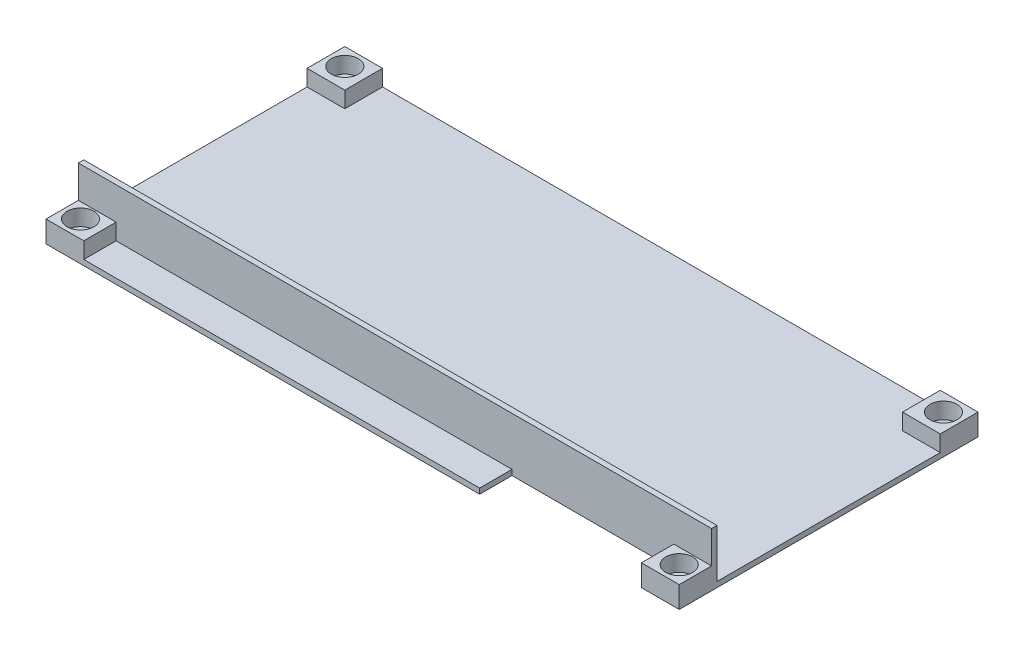
ISO-10303-21;
HEADER;
FILE_DESCRIPTION(('STEP AP214'),'2;1');
FILE_NAME('part.step','',(''),(''),'','','');
FILE_SCHEMA(('AUTOMOTIVE_DESIGN { 1 0 10303 214 1 1 1 1 }'));
ENDSEC;
DATA;
#1=APPLICATION_CONTEXT('core data for automotive mechanical design processes');
#2=APPLICATION_PROTOCOL_DEFINITION('international standard','automotive_design',2000,#1);
#3=PRODUCT_CONTEXT('',#1,'mechanical');
#4=PRODUCT('Part','Part','',(#3));
#5=PRODUCT_RELATED_PRODUCT_CATEGORY('part','',(#4));
#6=PRODUCT_DEFINITION_FORMATION('','',#4);
#7=PRODUCT_DEFINITION_CONTEXT('part definition',#1,'design');
#8=PRODUCT_DEFINITION('design','',#6,#7);
#9=PRODUCT_DEFINITION_SHAPE('','',#8);
#10=(LENGTH_UNIT() NAMED_UNIT(*) SI_UNIT(.MILLI.,.METRE.));
#11=(NAMED_UNIT(*) PLANE_ANGLE_UNIT() SI_UNIT($,.RADIAN.));
#12=(NAMED_UNIT(*) SI_UNIT($,.STERADIAN.) SOLID_ANGLE_UNIT());
#13=UNCERTAINTY_MEASURE_WITH_UNIT(LENGTH_MEASURE(1.E-05),#10,'distance_accuracy_value','');
#14=(GEOMETRIC_REPRESENTATION_CONTEXT(3) GLOBAL_UNCERTAINTY_ASSIGNED_CONTEXT((#13)) GLOBAL_UNIT_ASSIGNED_CONTEXT((#10,
#11,#12)) REPRESENTATION_CONTEXT('',''));
#15=CARTESIAN_POINT('',(0.,0.,0.));
#16=DIRECTION('',(0.,0.,1.));
#17=DIRECTION('',(1.,0.,0.));
#18=AXIS2_PLACEMENT_3D('',#15,#16,#17);
#19=CARTESIAN_POINT('',(0.,1.,0.));
#20=DIRECTION('',(0.,-1.,0.));
#21=DIRECTION('',(0.,0.,-1.));
#22=AXIS2_PLACEMENT_3D('',#19,#20,#21);
#23=PLANE('',#22);
#24=DIRECTION('',(0.,0.,1.));
#25=VECTOR('',#24,1.);
#26=CARTESIAN_POINT('',(-58.7,1.,27.7));
#27=LINE('',#26,#25);
#28=CARTESIAN_POINT('',(-58.7,1.,-20.7));
#29=VERTEX_POINT('',#28);
#30=CARTESIAN_POINT('',(-58.7,1.,20.7));
#31=VERTEX_POINT('',#30);
#32=EDGE_CURVE('E343',#29,#31,#27,.T.);
#33=ORIENTED_EDGE('',*,*,#32,.T.);
#34=DIRECTION('',(-1.,0.,0.));
#35=VECTOR('',#34,1.);
#36=CARTESIAN_POINT('',(58.7,1.,20.7));
#37=LINE('',#36,#35);
#38=CARTESIAN_POINT('',(58.7,1.,20.7));
#39=VERTEX_POINT('',#38);
#40=EDGE_CURVE('E283',#39,#31,#37,.T.);
#41=ORIENTED_EDGE('',*,*,#40,.F.);
#42=DIRECTION('',(0.,0.,-1.));
#43=VECTOR('',#42,1.);
#44=CARTESIAN_POINT('',(58.7,1.,27.7));
#45=LINE('',#44,#43);
#46=CARTESIAN_POINT('',(58.7,1.,-20.7));
#47=VERTEX_POINT('',#46);
#48=EDGE_CURVE('E180',#39,#47,#45,.T.);
#49=ORIENTED_EDGE('',*,*,#48,.T.);
#50=DIRECTION('',(1.,0.,0.));
#51=VECTOR('',#50,1.);
#52=CARTESIAN_POINT('',(58.7,1.,-20.7));
#53=LINE('',#52,#51);
#54=CARTESIAN_POINT('',(51.7,1.,-20.7));
#55=VERTEX_POINT('',#54);
#56=EDGE_CURVE('E295',#55,#47,#53,.T.);
#57=ORIENTED_EDGE('',*,*,#56,.F.);
#58=DIRECTION('',(0.,0.,1.));
#59=VECTOR('',#58,1.);
#60=CARTESIAN_POINT('',(51.7,1.,-27.7));
#61=LINE('',#60,#59);
#62=CARTESIAN_POINT('',(51.7,1.,-27.7));
#63=VERTEX_POINT('',#62);
#64=EDGE_CURVE('E182',#63,#55,#61,.T.);
#65=ORIENTED_EDGE('',*,*,#64,.F.);
#66=DIRECTION('',(-1.,0.,0.));
#67=VECTOR('',#66,1.);
#68=CARTESIAN_POINT('',(-58.7,1.,-27.7));
#69=LINE('',#68,#67);
#70=CARTESIAN_POINT('',(-51.7,1.,-27.7));
#71=VERTEX_POINT('',#70);
#72=EDGE_CURVE('E340',#63,#71,#69,.T.);
#73=ORIENTED_EDGE('',*,*,#72,.T.);
#74=DIRECTION('',(0.,0.,-1.));
#75=VECTOR('',#74,1.);
#76=CARTESIAN_POINT('',(-51.7,1.,-27.7));
#77=LINE('',#76,#75);
#78=CARTESIAN_POINT('',(-51.7,1.,-20.7));
#79=VERTEX_POINT('',#78);
#80=EDGE_CURVE('E318',#79,#71,#77,.T.);
#81=ORIENTED_EDGE('',*,*,#80,.F.);
#82=DIRECTION('',(1.,0.,0.));
#83=VECTOR('',#82,1.);
#84=CARTESIAN_POINT('',(-58.7,1.,-20.7));
#85=LINE('',#84,#83);
#86=EDGE_CURVE('E313',#29,#79,#85,.T.);
#87=ORIENTED_EDGE('',*,*,#86,.F.);
#88=EDGE_LOOP('',(#33,#41,#49,#57,#65,#73,#81,#87));
#89=FACE_BOUND('',#88,.T.);
#90=ADVANCED_FACE('F35',(#89),#23,.F.);
#91=DIRECTION('',(1.,0.,0.));
#92=VECTOR('',#91,1.);
#93=CARTESIAN_POINT('',(58.7,1.,21.7));
#94=LINE('',#93,#92);
#95=CARTESIAN_POINT('',(-51.7,1.,21.7));
#96=VERTEX_POINT('',#95);
#97=CARTESIAN_POINT('',(21.7,1.,21.7));
#98=VERTEX_POINT('',#97);
#99=EDGE_CURVE('E198',#96,#98,#94,.T.);
#100=ORIENTED_EDGE('',*,*,#99,.F.);
#101=DIRECTION('',(0.,0.,-1.));
#102=VECTOR('',#101,1.);
#103=CARTESIAN_POINT('',(-51.7,1.,27.7));
#104=LINE('',#103,#102);
#105=CARTESIAN_POINT('',(-51.7,1.,27.7));
#106=VERTEX_POINT('',#105);
#107=EDGE_CURVE('E269',#106,#96,#104,.T.);
#108=ORIENTED_EDGE('',*,*,#107,.F.);
#109=DIRECTION('',(1.,0.,0.));
#110=VECTOR('',#109,1.);
#111=CARTESIAN_POINT('',(-58.7,1.,27.7));
#112=LINE('',#111,#110);
#113=CARTESIAN_POINT('',(21.7,1.,27.7));
#114=VERTEX_POINT('',#113);
#115=EDGE_CURVE('E346',#106,#114,#112,.T.);
#116=ORIENTED_EDGE('',*,*,#115,.T.);
#117=DIRECTION('',(0.,0.,-1.));
#118=VECTOR('',#117,1.);
#119=CARTESIAN_POINT('',(21.7,1.,0.));
#120=LINE('',#119,#118);
#121=EDGE_CURVE('E251',#114,#98,#120,.T.);
#122=ORIENTED_EDGE('',*,*,#121,.T.);
#123=EDGE_LOOP('',(#100,#108,#116,#122));
#124=FACE_BOUND('',#123,.T.);
#125=ADVANCED_FACE('F399',(#124),#23,.F.);
#126=CARTESIAN_POINT('',(51.7,4.,27.7));
#127=DIRECTION('',(1.,0.,0.));
#128=DIRECTION('',(0.,0.,-1.));
#129=AXIS2_PLACEMENT_3D('',#126,#127,#128);
#130=PLANE('',#129);
#131=DIRECTION('',(0.,0.,1.));
#132=VECTOR('',#131,1.);
#133=CARTESIAN_POINT('',(51.7,4.,27.7));
#134=LINE('',#133,#132);
#135=CARTESIAN_POINT('',(51.7,4.,21.7));
#136=VERTEX_POINT('',#135);
#137=CARTESIAN_POINT('',(51.7,4.,27.7));
#138=VERTEX_POINT('',#137);
#139=EDGE_CURVE('E287',#136,#138,#134,.T.);
#140=ORIENTED_EDGE('',*,*,#139,.F.);
#141=DIRECTION('',(0.,-1.,0.));
#142=VECTOR('',#141,1.);
#143=CARTESIAN_POINT('',(51.7,4.,21.7));
#144=LINE('',#143,#142);
#145=CARTESIAN_POINT('',(51.7,0.,21.7));
#146=VERTEX_POINT('',#145);
#147=EDGE_CURVE('E50',#136,#146,#144,.T.);
#148=ORIENTED_EDGE('',*,*,#147,.T.);
#149=DIRECTION('',(0.,0.,1.));
#150=VECTOR('',#149,1.);
#151=CARTESIAN_POINT('',(51.7,0.,27.7));
#152=LINE('',#151,#150);
#153=CARTESIAN_POINT('',(51.7,0.,27.7));
#154=VERTEX_POINT('',#153);
#155=EDGE_CURVE('E240',#146,#154,#152,.T.);
#156=ORIENTED_EDGE('',*,*,#155,.T.);
#157=DIRECTION('',(0.,-1.,0.));
#158=VECTOR('',#157,1.);
#159=CARTESIAN_POINT('',(51.7,4.,27.7));
#160=LINE('',#159,#158);
#161=EDGE_CURVE('E183',#138,#154,#160,.T.);
#162=ORIENTED_EDGE('',*,*,#161,.F.);
#163=EDGE_LOOP('',(#140,#148,#156,#162));
#164=FACE_BOUND('',#163,.T.);
#165=ADVANCED_FACE('F405',(#164),#130,.F.);
#166=CARTESIAN_POINT('',(0.,4.,0.));
#167=DIRECTION('',(0.,-1.,0.));
#168=DIRECTION('',(0.,0.,-1.));
#169=AXIS2_PLACEMENT_3D('',#166,#167,#168);
#170=PLANE('',#169);
#171=CARTESIAN_POINT('',(55.5,4.,24.5));
#172=DIRECTION('',(0.,1.,0.));
#173=DIRECTION('',(0.,0.,1.));
#174=AXIS2_PLACEMENT_3D('',#171,#172,#173);
#175=CIRCLE('',#174,2.5);
#176=CARTESIAN_POINT('',(55.5,4.,27.));
#177=VERTEX_POINT('',#176);
#178=EDGE_CURVE('E224',#177,#177,#175,.T.);
#179=ORIENTED_EDGE('',*,*,#178,.F.);
#180=EDGE_LOOP('',(#179));
#181=FACE_BOUND('',#180,.T.);
#182=DIRECTION('',(1.,0.,0.));
#183=VECTOR('',#182,1.);
#184=CARTESIAN_POINT('',(0.,4.,21.7));
#185=LINE('',#184,#183);
#186=CARTESIAN_POINT('',(58.7,4.,21.7));
#187=VERTEX_POINT('',#186);
#188=EDGE_CURVE('E213',#136,#187,#185,.T.);
#189=ORIENTED_EDGE('',*,*,#188,.F.);
#190=ORIENTED_EDGE('',*,*,#139,.T.);
#191=DIRECTION('',(1.,0.,0.));
#192=VECTOR('',#191,1.);
#193=CARTESIAN_POINT('',(58.7,4.,27.7));
#194=LINE('',#193,#192);
#195=CARTESIAN_POINT('',(58.7,4.,27.7));
#196=VERTEX_POINT('',#195);
#197=EDGE_CURVE('E284',#138,#196,#194,.T.);
#198=ORIENTED_EDGE('',*,*,#197,.T.);
#199=DIRECTION('',(0.,0.,-1.));
#200=VECTOR('',#199,1.);
#201=CARTESIAN_POINT('',(58.7,4.,27.7));
#202=LINE('',#201,#200);
#203=EDGE_CURVE('E57',#196,#187,#202,.T.);
#204=ORIENTED_EDGE('',*,*,#203,.T.);
#205=EDGE_LOOP('',(#189,#190,#198,#204));
#206=FACE_BOUND('',#205,.T.);
#207=ADVANCED_FACE('F449',(#181,#206),#170,.F.);
#208=CARTESIAN_POINT('',(-51.7,4.,27.7));
#209=DIRECTION('',(-1.,0.,0.));
#210=DIRECTION('',(0.,0.,1.));
#211=AXIS2_PLACEMENT_3D('',#208,#209,#210);
#212=PLANE('',#211);
#213=DIRECTION('',(0.,-1.,0.));
#214=VECTOR('',#213,1.);
#215=CARTESIAN_POINT('',(-51.7,4.,21.7));
#216=LINE('',#215,#214);
#217=CARTESIAN_POINT('',(-51.7,4.,21.7));
#218=VERTEX_POINT('',#217);
#219=EDGE_CURVE('E210',#218,#96,#216,.T.);
#220=ORIENTED_EDGE('',*,*,#219,.F.);
#221=DIRECTION('',(0.,0.,-1.));
#222=VECTOR('',#221,1.);
#223=CARTESIAN_POINT('',(-51.7,4.,27.7));
#224=LINE('',#223,#222);
#225=CARTESIAN_POINT('',(-51.7,4.,27.7));
#226=VERTEX_POINT('',#225);
#227=EDGE_CURVE('E274',#226,#218,#224,.T.);
#228=ORIENTED_EDGE('',*,*,#227,.F.);
#229=DIRECTION('',(0.,-1.,0.));
#230=VECTOR('',#229,1.);
#231=CARTESIAN_POINT('',(-51.7,4.,27.7));
#232=LINE('',#231,#230);
#233=EDGE_CURVE('E280',#226,#106,#232,.T.);
#234=ORIENTED_EDGE('',*,*,#233,.T.);
#235=ORIENTED_EDGE('',*,*,#107,.T.);
#236=EDGE_LOOP('',(#220,#228,#234,#235));
#237=FACE_BOUND('',#236,.T.);
#238=ADVANCED_FACE('F593',(#237),#212,.F.);
#239=CARTESIAN_POINT('',(0.,4.,0.));
#240=DIRECTION('',(0.,-1.,0.));
#241=DIRECTION('',(0.,0.,-1.));
#242=AXIS2_PLACEMENT_3D('',#239,#240,#241);
#243=PLANE('',#242);
#244=CARTESIAN_POINT('',(-55.5,4.,24.5));
#245=DIRECTION('',(0.,1.,0.));
#246=DIRECTION('',(0.,0.,1.));
#247=AXIS2_PLACEMENT_3D('',#244,#245,#246);
#248=CIRCLE('',#247,2.5);
#249=CARTESIAN_POINT('',(-55.5,4.,27.));
#250=VERTEX_POINT('',#249);
#251=EDGE_CURVE('E215',#250,#250,#248,.T.);
#252=ORIENTED_EDGE('',*,*,#251,.F.);
#253=EDGE_LOOP('',(#252));
#254=FACE_BOUND('',#253,.T.);
#255=DIRECTION('',(1.,0.,0.));
#256=VECTOR('',#255,1.);
#257=CARTESIAN_POINT('',(0.,4.,21.7));
#258=LINE('',#257,#256);
#259=CARTESIAN_POINT('',(-58.7,4.,21.7));
#260=VERTEX_POINT('',#259);
#261=EDGE_CURVE('E12',#260,#218,#258,.T.);
#262=ORIENTED_EDGE('',*,*,#261,.F.);
#263=DIRECTION('',(0.,0.,1.));
#264=VECTOR('',#263,1.);
#265=CARTESIAN_POINT('',(-58.7,4.,27.7));
#266=LINE('',#265,#264);
#267=CARTESIAN_POINT('',(-58.7,4.,27.7));
#268=VERTEX_POINT('',#267);
#269=EDGE_CURVE('E270',#260,#268,#266,.T.);
#270=ORIENTED_EDGE('',*,*,#269,.T.);
#271=DIRECTION('',(1.,0.,0.));
#272=VECTOR('',#271,1.);
#273=CARTESIAN_POINT('',(-58.7,4.,27.7));
#274=LINE('',#273,#272);
#275=EDGE_CURVE('E272',#268,#226,#274,.T.);
#276=ORIENTED_EDGE('',*,*,#275,.T.);
#277=ORIENTED_EDGE('',*,*,#227,.T.);
#278=EDGE_LOOP('',(#262,#270,#276,#277));
#279=FACE_BOUND('',#278,.T.);
#280=ADVANCED_FACE('F602',(#254,#279),#243,.F.);
#281=CARTESIAN_POINT('',(-58.7,1.,27.7));
#282=DIRECTION('',(0.,0.,-1.));
#283=DIRECTION('',(-1.,0.,0.));
#284=AXIS2_PLACEMENT_3D('',#281,#282,#283);
#285=PLANE('',#284);
#286=ORIENTED_EDGE('',*,*,#161,.T.);
#287=DIRECTION('',(1.,0.,0.));
#288=VECTOR('',#287,1.);
#289=CARTESIAN_POINT('',(-58.7,0.,27.7));
#290=LINE('',#289,#288);
#291=CARTESIAN_POINT('',(58.7,0.,27.7));
#292=VERTEX_POINT('',#291);
#293=EDGE_CURVE('E356',#154,#292,#290,.T.);
#294=ORIENTED_EDGE('',*,*,#293,.T.);
#295=DIRECTION('',(0.,-1.,0.));
#296=VECTOR('',#295,1.);
#297=CARTESIAN_POINT('',(58.7,1.,27.7));
#298=LINE('',#297,#296);
#299=EDGE_CURVE('E349',#196,#292,#298,.T.);
#300=ORIENTED_EDGE('',*,*,#299,.F.);
#301=ORIENTED_EDGE('',*,*,#197,.F.);
#302=EDGE_LOOP('',(#286,#294,#300,#301));
#303=FACE_BOUND('',#302,.T.);
#304=ADVANCED_FACE('F420',(#303),#285,.F.);
#305=CARTESIAN_POINT('',(58.7,1.,27.7));
#306=DIRECTION('',(-1.,0.,0.));
#307=DIRECTION('',(0.,0.,1.));
#308=AXIS2_PLACEMENT_3D('',#305,#306,#307);
#309=PLANE('',#308);
#310=DIRECTION('',(0.,-1.,0.));
#311=VECTOR('',#310,1.);
#312=CARTESIAN_POINT('',(58.7,4.,20.7));
#313=LINE('',#312,#311);
#314=CARTESIAN_POINT('',(58.7,10.,20.7));
#315=VERTEX_POINT('',#314);
#316=EDGE_CURVE('E174',#315,#39,#313,.T.);
#317=ORIENTED_EDGE('',*,*,#316,.F.);
#318=DIRECTION('',(0.,0.,-1.));
#319=VECTOR('',#318,1.);
#320=CARTESIAN_POINT('',(58.7,10.,21.7));
#321=LINE('',#320,#319);
#322=CARTESIAN_POINT('',(58.7,10.,21.7));
#323=VERTEX_POINT('',#322);
#324=EDGE_CURVE('E178',#323,#315,#321,.T.);
#325=ORIENTED_EDGE('',*,*,#324,.F.);
#326=DIRECTION('',(0.,-1.,0.));
#327=VECTOR('',#326,1.);
#328=CARTESIAN_POINT('',(58.7,10.,21.7));
#329=LINE('',#328,#327);
#330=EDGE_CURVE('E204',#323,#187,#329,.T.);
#331=ORIENTED_EDGE('',*,*,#330,.T.);
#332=ORIENTED_EDGE('',*,*,#203,.F.);
#333=ORIENTED_EDGE('',*,*,#299,.T.);
#334=DIRECTION('',(0.,0.,-1.));
#335=VECTOR('',#334,1.);
#336=CARTESIAN_POINT('',(58.7,0.,27.7));
#337=LINE('',#336,#335);
#338=CARTESIAN_POINT('',(58.7,0.,-27.7));
#339=VERTEX_POINT('',#338);
#340=EDGE_CURVE('E338',#292,#339,#337,.T.);
#341=ORIENTED_EDGE('',*,*,#340,.T.);
#342=DIRECTION('',(0.,-1.,0.));
#343=VECTOR('',#342,1.);
#344=CARTESIAN_POINT('',(58.7,1.,-27.7));
#345=LINE('',#344,#343);
#346=CARTESIAN_POINT('',(58.7,4.,-27.7));
#347=VERTEX_POINT('',#346);
#348=EDGE_CURVE('E43',#347,#339,#345,.T.);
#349=ORIENTED_EDGE('',*,*,#348,.F.);
#350=DIRECTION('',(0.,0.,-1.));
#351=VECTOR('',#350,1.);
#352=CARTESIAN_POINT('',(58.7,4.,-27.7));
#353=LINE('',#352,#351);
#354=CARTESIAN_POINT('',(58.7,4.,-20.7));
#355=VERTEX_POINT('',#354);
#356=EDGE_CURVE('E291',#355,#347,#353,.T.);
#357=ORIENTED_EDGE('',*,*,#356,.F.);
#358=DIRECTION('',(0.,-1.,0.));
#359=VECTOR('',#358,1.);
#360=CARTESIAN_POINT('',(58.7,4.,-20.7));
#361=LINE('',#360,#359);
#362=EDGE_CURVE('E301',#355,#47,#361,.T.);
#363=ORIENTED_EDGE('',*,*,#362,.T.);
#364=ORIENTED_EDGE('',*,*,#48,.F.);
#365=EDGE_LOOP('',(#317,#325,#331,#332,#333,#341,#349,#357,#363,#364));
#366=FACE_BOUND('',#365,.T.);
#367=ADVANCED_FACE('F37',(#366),#309,.F.);
#368=CARTESIAN_POINT('',(-58.7,1.,-27.7));
#369=DIRECTION('',(0.,0.,1.));
#370=DIRECTION('',(1.,0.,0.));
#371=AXIS2_PLACEMENT_3D('',#368,#369,#370);
#372=PLANE('',#371);
#373=DIRECTION('',(-1.,0.,0.));
#374=VECTOR('',#373,1.);
#375=CARTESIAN_POINT('',(-58.7,0.,-27.7));
#376=LINE('',#375,#374);
#377=CARTESIAN_POINT('',(-58.7,0.,-27.7));
#378=VERTEX_POINT('',#377);
#379=EDGE_CURVE('E352',#339,#378,#376,.T.);
#380=ORIENTED_EDGE('',*,*,#379,.T.);
#381=DIRECTION('',(0.,-1.,0.));
#382=VECTOR('',#381,1.);
#383=CARTESIAN_POINT('',(-58.7,1.,-27.7));
#384=LINE('',#383,#382);
#385=CARTESIAN_POINT('',(-58.7,4.,-27.7));
#386=VERTEX_POINT('',#385);
#387=EDGE_CURVE('E364',#386,#378,#384,.T.);
#388=ORIENTED_EDGE('',*,*,#387,.F.);
#389=DIRECTION('',(-1.,0.,0.));
#390=VECTOR('',#389,1.);
#391=CARTESIAN_POINT('',(-58.7,4.,-27.7));
#392=LINE('',#391,#390);
#393=CARTESIAN_POINT('',(-51.7,4.,-27.7));
#394=VERTEX_POINT('',#393);
#395=EDGE_CURVE('E322',#394,#386,#392,.T.);
#396=ORIENTED_EDGE('',*,*,#395,.F.);
#397=DIRECTION('',(0.,-1.,0.));
#398=VECTOR('',#397,1.);
#399=CARTESIAN_POINT('',(-51.7,4.,-27.7));
#400=LINE('',#399,#398);
#401=EDGE_CURVE('E325',#394,#71,#400,.T.);
#402=ORIENTED_EDGE('',*,*,#401,.T.);
#403=ORIENTED_EDGE('',*,*,#72,.F.);
#404=DIRECTION('',(0.,-1.,0.));
#405=VECTOR('',#404,1.);
#406=CARTESIAN_POINT('',(51.7,4.,-27.7));
#407=LINE('',#406,#405);
#408=CARTESIAN_POINT('',(51.7,4.,-27.7));
#409=VERTEX_POINT('',#408);
#410=EDGE_CURVE('E310',#409,#63,#407,.T.);
#411=ORIENTED_EDGE('',*,*,#410,.F.);
#412=DIRECTION('',(-1.,0.,0.));
#413=VECTOR('',#412,1.);
#414=CARTESIAN_POINT('',(58.7,4.,-27.7));
#415=LINE('',#414,#413);
#416=EDGE_CURVE('E294',#347,#409,#415,.T.);
#417=ORIENTED_EDGE('',*,*,#416,.F.);
#418=ORIENTED_EDGE('',*,*,#348,.T.);
#419=EDGE_LOOP('',(#380,#388,#396,#402,#403,#411,#417,#418));
#420=FACE_BOUND('',#419,.T.);
#421=ADVANCED_FACE('F422',(#420),#372,.F.);
#422=CARTESIAN_POINT('',(-58.7,1.,27.7));
#423=DIRECTION('',(1.,0.,0.));
#424=DIRECTION('',(0.,0.,-1.));
#425=AXIS2_PLACEMENT_3D('',#422,#423,#424);
#426=PLANE('',#425);
#427=ORIENTED_EDGE('',*,*,#269,.F.);
#428=DIRECTION('',(0.,-1.,0.));
#429=VECTOR('',#428,1.);
#430=CARTESIAN_POINT('',(-58.7,10.,21.7));
#431=LINE('',#430,#429);
#432=CARTESIAN_POINT('',(-58.7,10.,21.7));
#433=VERTEX_POINT('',#432);
#434=EDGE_CURVE('E207',#433,#260,#431,.T.);
#435=ORIENTED_EDGE('',*,*,#434,.F.);
#436=DIRECTION('',(0.,0.,1.));
#437=VECTOR('',#436,1.);
#438=CARTESIAN_POINT('',(-58.7,10.,21.7));
#439=LINE('',#438,#437);
#440=CARTESIAN_POINT('',(-58.7,10.,20.7));
#441=VERTEX_POINT('',#440);
#442=EDGE_CURVE('E192',#441,#433,#439,.T.);
#443=ORIENTED_EDGE('',*,*,#442,.F.);
#444=DIRECTION('',(0.,-1.,0.));
#445=VECTOR('',#444,1.);
#446=CARTESIAN_POINT('',(-58.7,4.,20.7));
#447=LINE('',#446,#445);
#448=EDGE_CURVE('E189',#441,#31,#447,.T.);
#449=ORIENTED_EDGE('',*,*,#448,.T.);
#450=ORIENTED_EDGE('',*,*,#32,.F.);
#451=DIRECTION('',(0.,-1.,0.));
#452=VECTOR('',#451,1.);
#453=CARTESIAN_POINT('',(-58.7,4.,-20.7));
#454=LINE('',#453,#452);
#455=CARTESIAN_POINT('',(-58.7,4.,-20.7));
#456=VERTEX_POINT('',#455);
#457=EDGE_CURVE('E335',#456,#29,#454,.T.);
#458=ORIENTED_EDGE('',*,*,#457,.F.);
#459=DIRECTION('',(0.,0.,1.));
#460=VECTOR('',#459,1.);
#461=CARTESIAN_POINT('',(-58.7,4.,-27.7));
#462=LINE('',#461,#460);
#463=EDGE_CURVE('E314',#386,#456,#462,.T.);
#464=ORIENTED_EDGE('',*,*,#463,.F.);
#465=ORIENTED_EDGE('',*,*,#387,.T.);
#466=DIRECTION('',(0.,0.,1.));
#467=VECTOR('',#466,1.);
#468=CARTESIAN_POINT('',(-58.7,0.,27.7));
#469=LINE('',#468,#467);
#470=CARTESIAN_POINT('',(-58.7,0.,27.7));
#471=VERTEX_POINT('',#470);
#472=EDGE_CURVE('E354',#378,#471,#469,.T.);
#473=ORIENTED_EDGE('',*,*,#472,.T.);
#474=DIRECTION('',(0.,-1.,0.));
#475=VECTOR('',#474,1.);
#476=CARTESIAN_POINT('',(-58.7,1.,27.7));
#477=LINE('',#476,#475);
#478=EDGE_CURVE('E361',#268,#471,#477,.T.);
#479=ORIENTED_EDGE('',*,*,#478,.F.);
#480=EDGE_LOOP('',(#427,#435,#443,#449,#450,#458,#464,#465,#473,#479));
#481=FACE_BOUND('',#480,.T.);
#482=ADVANCED_FACE('F418',(#481),#426,.F.);
#483=CARTESIAN_POINT('',(21.7,0.,27.7));
#484=VERTEX_POINT('',#483);
#485=EDGE_CURVE('E341',#471,#484,#290,.T.);
#486=ORIENTED_EDGE('',*,*,#485,.T.);
#487=DIRECTION('',(0.,-1.,0.));
#488=VECTOR('',#487,1.);
#489=CARTESIAN_POINT('',(21.7,4.,27.7));
#490=LINE('',#489,#488);
#491=EDGE_CURVE('E249',#114,#484,#490,.T.);
#492=ORIENTED_EDGE('',*,*,#491,.F.);
#493=ORIENTED_EDGE('',*,*,#115,.F.);
#494=ORIENTED_EDGE('',*,*,#233,.F.);
#495=ORIENTED_EDGE('',*,*,#275,.F.);
#496=ORIENTED_EDGE('',*,*,#478,.T.);
#497=EDGE_LOOP('',(#486,#492,#493,#494,#495,#496));
#498=FACE_BOUND('',#497,.T.);
#499=ADVANCED_FACE('F414',(#498),#285,.F.);
#500=CARTESIAN_POINT('',(0.,0.,0.));
#501=DIRECTION('',(0.,-1.,0.));
#502=DIRECTION('',(0.,0.,-1.));
#503=AXIS2_PLACEMENT_3D('',#500,#501,#502);
#504=PLANE('',#503);
#505=ORIENTED_EDGE('',*,*,#155,.F.);
#506=DIRECTION('',(1.,0.,0.));
#507=VECTOR('',#506,1.);
#508=CARTESIAN_POINT('',(51.7,0.,21.7));
#509=LINE('',#508,#507);
#510=CARTESIAN_POINT('',(21.7,0.,21.7));
#511=VERTEX_POINT('',#510);
#512=EDGE_CURVE('E247',#511,#146,#509,.T.);
#513=ORIENTED_EDGE('',*,*,#512,.F.);
#514=DIRECTION('',(0.,0.,-1.));
#515=VECTOR('',#514,1.);
#516=CARTESIAN_POINT('',(21.7,0.,27.7));
#517=LINE('',#516,#515);
#518=EDGE_CURVE('E243',#484,#511,#517,.T.);
#519=ORIENTED_EDGE('',*,*,#518,.F.);
#520=ORIENTED_EDGE('',*,*,#485,.F.);
#521=ORIENTED_EDGE('',*,*,#472,.F.);
#522=ORIENTED_EDGE('',*,*,#379,.F.);
#523=ORIENTED_EDGE('',*,*,#340,.F.);
#524=ORIENTED_EDGE('',*,*,#293,.F.);
#525=EDGE_LOOP('',(#505,#513,#519,#520,#521,#522,#523,#524));
#526=FACE_BOUND('',#525,.T.);
#527=CARTESIAN_POINT('',(-55.5,0.,24.5));
#528=DIRECTION('',(0.,1.,0.));
#529=DIRECTION('',(0.,0.,1.));
#530=AXIS2_PLACEMENT_3D('',#527,#528,#529);
#531=CIRCLE('',#530,1.35);
#532=CARTESIAN_POINT('',(-55.5,0.,25.85));
#533=VERTEX_POINT('',#532);
#534=EDGE_CURVE('E257',#533,#533,#531,.T.);
#535=ORIENTED_EDGE('',*,*,#534,.T.);
#536=EDGE_LOOP('',(#535));
#537=FACE_BOUND('',#536,.T.);
#538=CARTESIAN_POINT('',(55.5,0.,24.5));
#539=DIRECTION('',(0.,1.,0.));
#540=DIRECTION('',(0.,0.,1.));
#541=AXIS2_PLACEMENT_3D('',#538,#539,#540);
#542=CIRCLE('',#541,1.35);
#543=CARTESIAN_POINT('',(55.5,0.,25.85));
#544=VERTEX_POINT('',#543);
#545=EDGE_CURVE('E262',#544,#544,#542,.T.);
#546=ORIENTED_EDGE('',*,*,#545,.T.);
#547=EDGE_LOOP('',(#546));
#548=FACE_BOUND('',#547,.T.);
#549=CARTESIAN_POINT('',(55.5,0.,-24.5));
#550=DIRECTION('',(0.,1.,0.));
#551=DIRECTION('',(0.,0.,1.));
#552=AXIS2_PLACEMENT_3D('',#549,#550,#551);
#553=CIRCLE('',#552,1.35);
#554=CARTESIAN_POINT('',(55.5,0.,-23.15));
#555=VERTEX_POINT('',#554);
#556=EDGE_CURVE('E258',#555,#555,#553,.T.);
#557=ORIENTED_EDGE('',*,*,#556,.T.);
#558=EDGE_LOOP('',(#557));
#559=FACE_BOUND('',#558,.T.);
#560=CARTESIAN_POINT('',(-55.5,0.,-24.5));
#561=DIRECTION('',(0.,1.,0.));
#562=DIRECTION('',(0.,0.,1.));
#563=AXIS2_PLACEMENT_3D('',#560,#561,#562);
#564=CIRCLE('',#563,1.35);
#565=CARTESIAN_POINT('',(-55.5,0.,-23.15));
#566=VERTEX_POINT('',#565);
#567=EDGE_CURVE('E261',#566,#566,#564,.T.);
#568=ORIENTED_EDGE('',*,*,#567,.T.);
#569=EDGE_LOOP('',(#568));
#570=FACE_BOUND('',#569,.T.);
#571=ADVANCED_FACE('F411',(#526,#537,#548,#559,#570),#504,.T.);
#572=CARTESIAN_POINT('',(-58.7,4.,-20.7));
#573=DIRECTION('',(0.,0.,-1.));
#574=DIRECTION('',(-1.,0.,0.));
#575=AXIS2_PLACEMENT_3D('',#572,#573,#574);
#576=PLANE('',#575);
#577=ORIENTED_EDGE('',*,*,#86,.T.);
#578=DIRECTION('',(0.,-1.,0.));
#579=VECTOR('',#578,1.);
#580=CARTESIAN_POINT('',(-51.7,4.,-20.7));
#581=LINE('',#580,#579);
#582=CARTESIAN_POINT('',(-51.7,4.,-20.7));
#583=VERTEX_POINT('',#582);
#584=EDGE_CURVE('E332',#583,#79,#581,.T.);
#585=ORIENTED_EDGE('',*,*,#584,.F.);
#586=DIRECTION('',(1.,0.,0.));
#587=VECTOR('',#586,1.);
#588=CARTESIAN_POINT('',(-58.7,4.,-20.7));
#589=LINE('',#588,#587);
#590=EDGE_CURVE('E317',#456,#583,#589,.T.);
#591=ORIENTED_EDGE('',*,*,#590,.F.);
#592=ORIENTED_EDGE('',*,*,#457,.T.);
#593=EDGE_LOOP('',(#577,#585,#591,#592));
#594=FACE_BOUND('',#593,.T.);
#595=ADVANCED_FACE('F409',(#594),#576,.F.);
#596=CARTESIAN_POINT('',(-51.7,4.,-27.7));
#597=DIRECTION('',(-1.,0.,0.));
#598=DIRECTION('',(0.,0.,1.));
#599=AXIS2_PLACEMENT_3D('',#596,#597,#598);
#600=PLANE('',#599);
#601=ORIENTED_EDGE('',*,*,#80,.T.);
#602=ORIENTED_EDGE('',*,*,#401,.F.);
#603=DIRECTION('',(0.,0.,-1.));
#604=VECTOR('',#603,1.);
#605=CARTESIAN_POINT('',(-51.7,4.,-27.7));
#606=LINE('',#605,#604);
#607=EDGE_CURVE('E320',#583,#394,#606,.T.);
#608=ORIENTED_EDGE('',*,*,#607,.F.);
#609=ORIENTED_EDGE('',*,*,#584,.T.);
#610=EDGE_LOOP('',(#601,#602,#608,#609));
#611=FACE_BOUND('',#610,.T.);
#612=ADVANCED_FACE('F475',(#611),#600,.F.);
#613=CARTESIAN_POINT('',(0.,4.,0.));
#614=DIRECTION('',(0.,1.,0.));
#615=DIRECTION('',(0.,0.,1.));
#616=AXIS2_PLACEMENT_3D('',#613,#614,#615);
#617=PLANE('',#616);
#618=CARTESIAN_POINT('',(-55.5,4.,-24.5));
#619=DIRECTION('',(0.,1.,0.));
#620=DIRECTION('',(0.,0.,1.));
#621=AXIS2_PLACEMENT_3D('',#618,#619,#620);
#622=CIRCLE('',#621,2.5);
#623=CARTESIAN_POINT('',(-55.5,4.,-22.));
#624=VERTEX_POINT('',#623);
#625=EDGE_CURVE('E223',#624,#624,#622,.T.);
#626=ORIENTED_EDGE('',*,*,#625,.F.);
#627=EDGE_LOOP('',(#626));
#628=FACE_BOUND('',#627,.T.);
#629=ORIENTED_EDGE('',*,*,#463,.T.);
#630=ORIENTED_EDGE('',*,*,#590,.T.);
#631=ORIENTED_EDGE('',*,*,#607,.T.);
#632=ORIENTED_EDGE('',*,*,#395,.T.);
#633=EDGE_LOOP('',(#629,#630,#631,#632));
#634=FACE_BOUND('',#633,.T.);
#635=ADVANCED_FACE('F468',(#628,#634),#617,.T.);
#636=CARTESIAN_POINT('',(51.7,4.,-27.7));
#637=DIRECTION('',(1.,0.,0.));
#638=DIRECTION('',(0.,0.,-1.));
#639=AXIS2_PLACEMENT_3D('',#636,#637,#638);
#640=PLANE('',#639);
#641=ORIENTED_EDGE('',*,*,#64,.T.);
#642=DIRECTION('',(0.,-1.,0.));
#643=VECTOR('',#642,1.);
#644=CARTESIAN_POINT('',(51.7,4.,-20.7));
#645=LINE('',#644,#643);
#646=CARTESIAN_POINT('',(51.7,4.,-20.7));
#647=VERTEX_POINT('',#646);
#648=EDGE_CURVE('E307',#647,#55,#645,.T.);
#649=ORIENTED_EDGE('',*,*,#648,.F.);
#650=DIRECTION('',(0.,0.,1.));
#651=VECTOR('',#650,1.);
#652=CARTESIAN_POINT('',(51.7,4.,-27.7));
#653=LINE('',#652,#651);
#654=EDGE_CURVE('E297',#409,#647,#653,.T.);
#655=ORIENTED_EDGE('',*,*,#654,.F.);
#656=ORIENTED_EDGE('',*,*,#410,.T.);
#657=EDGE_LOOP('',(#641,#649,#655,#656));
#658=FACE_BOUND('',#657,.T.);
#659=ADVANCED_FACE('F466',(#658),#640,.F.);
#660=CARTESIAN_POINT('',(58.7,4.,-20.7));
#661=DIRECTION('',(0.,0.,-1.));
#662=DIRECTION('',(-1.,0.,0.));
#663=AXIS2_PLACEMENT_3D('',#660,#661,#662);
#664=PLANE('',#663);
#665=ORIENTED_EDGE('',*,*,#56,.T.);
#666=ORIENTED_EDGE('',*,*,#362,.F.);
#667=DIRECTION('',(1.,0.,0.));
#668=VECTOR('',#667,1.);
#669=CARTESIAN_POINT('',(58.7,4.,-20.7));
#670=LINE('',#669,#668);
#671=EDGE_CURVE('E299',#647,#355,#670,.T.);
#672=ORIENTED_EDGE('',*,*,#671,.F.);
#673=ORIENTED_EDGE('',*,*,#648,.T.);
#674=EDGE_LOOP('',(#665,#666,#672,#673));
#675=FACE_BOUND('',#674,.T.);
#676=ADVANCED_FACE('F463',(#675),#664,.F.);
#677=CARTESIAN_POINT('',(0.,4.,0.));
#678=DIRECTION('',(0.,-1.,0.));
#679=DIRECTION('',(0.,0.,-1.));
#680=AXIS2_PLACEMENT_3D('',#677,#678,#679);
#681=PLANE('',#680);
#682=CARTESIAN_POINT('',(55.5,4.,-24.5));
#683=DIRECTION('',(0.,1.,0.));
#684=DIRECTION('',(0.,0.,1.));
#685=AXIS2_PLACEMENT_3D('',#682,#683,#684);
#686=CIRCLE('',#685,2.5);
#687=CARTESIAN_POINT('',(55.5,4.,-22.));
#688=VERTEX_POINT('',#687);
#689=EDGE_CURVE('E216',#688,#688,#686,.T.);
#690=ORIENTED_EDGE('',*,*,#689,.F.);
#691=EDGE_LOOP('',(#690));
#692=FACE_BOUND('',#691,.T.);
#693=ORIENTED_EDGE('',*,*,#356,.T.);
#694=ORIENTED_EDGE('',*,*,#416,.T.);
#695=ORIENTED_EDGE('',*,*,#654,.T.);
#696=ORIENTED_EDGE('',*,*,#671,.T.);
#697=EDGE_LOOP('',(#693,#694,#695,#696));
#698=FACE_BOUND('',#697,.T.);
#699=ADVANCED_FACE('F458',(#692,#698),#681,.F.);
#700=CARTESIAN_POINT('',(58.7,4.,20.7));
#701=DIRECTION('',(0.,0.,1.));
#702=DIRECTION('',(1.,0.,0.));
#703=AXIS2_PLACEMENT_3D('',#700,#701,#702);
#704=PLANE('',#703);
#705=ORIENTED_EDGE('',*,*,#40,.T.);
#706=ORIENTED_EDGE('',*,*,#448,.F.);
#707=DIRECTION('',(-1.,0.,0.));
#708=VECTOR('',#707,1.);
#709=CARTESIAN_POINT('',(58.7,10.,20.7));
#710=LINE('',#709,#708);
#711=EDGE_CURVE('E186',#315,#441,#710,.T.);
#712=ORIENTED_EDGE('',*,*,#711,.F.);
#713=ORIENTED_EDGE('',*,*,#316,.T.);
#714=EDGE_LOOP('',(#705,#706,#712,#713));
#715=FACE_BOUND('',#714,.T.);
#716=ADVANCED_FACE('F187',(#715),#704,.F.);
#717=CARTESIAN_POINT('',(-55.5,0.,24.5));
#718=DIRECTION('',(0.,1.,0.));
#719=DIRECTION('',(0.,0.,1.));
#720=AXIS2_PLACEMENT_3D('',#717,#718,#719);
#721=CYLINDRICAL_SURFACE('',#720,1.35);
#722=CARTESIAN_POINT('',(-55.5,1.,24.5));
#723=DIRECTION('',(0.,-1.,0.));
#724=DIRECTION('',(0.,0.,-1.));
#725=AXIS2_PLACEMENT_3D('',#722,#723,#724);
#726=CIRCLE('',#725,1.35);
#727=CARTESIAN_POINT('',(-55.5,1.,23.15));
#728=VERTEX_POINT('',#727);
#729=EDGE_CURVE('E244',#728,#728,#726,.F.);
#730=ORIENTED_EDGE('',*,*,#729,.T.);
#731=EDGE_LOOP('',(#730));
#732=FACE_BOUND('',#731,.T.);
#733=ORIENTED_EDGE('',*,*,#534,.F.);
#734=EDGE_LOOP('',(#733));
#735=FACE_BOUND('',#734,.T.);
#736=ADVANCED_FACE('F379',(#732,#735),#721,.F.);
#737=CARTESIAN_POINT('',(55.5,0.,24.5));
#738=DIRECTION('',(0.,1.,0.));
#739=DIRECTION('',(0.,0.,1.));
#740=AXIS2_PLACEMENT_3D('',#737,#738,#739);
#741=CYLINDRICAL_SURFACE('',#740,1.35);
#742=CARTESIAN_POINT('',(55.5,1.,24.5));
#743=DIRECTION('',(0.,-1.,0.));
#744=DIRECTION('',(0.,0.,-1.));
#745=AXIS2_PLACEMENT_3D('',#742,#743,#744);
#746=CIRCLE('',#745,1.35);
#747=CARTESIAN_POINT('',(55.5,1.,23.15));
#748=VERTEX_POINT('',#747);
#749=EDGE_CURVE('E374',#748,#748,#746,.F.);
#750=ORIENTED_EDGE('',*,*,#749,.T.);
#751=EDGE_LOOP('',(#750));
#752=FACE_BOUND('',#751,.T.);
#753=ORIENTED_EDGE('',*,*,#545,.F.);
#754=EDGE_LOOP('',(#753));
#755=FACE_BOUND('',#754,.T.);
#756=ADVANCED_FACE('F655',(#752,#755),#741,.F.);
#757=CARTESIAN_POINT('',(55.5,0.,-24.5));
#758=DIRECTION('',(0.,1.,0.));
#759=DIRECTION('',(0.,0.,1.));
#760=AXIS2_PLACEMENT_3D('',#757,#758,#759);
#761=CYLINDRICAL_SURFACE('',#760,1.35);
#762=CARTESIAN_POINT('',(55.5,1.,-24.5));
#763=DIRECTION('',(0.,-1.,0.));
#764=DIRECTION('',(0.,0.,-1.));
#765=AXIS2_PLACEMENT_3D('',#762,#763,#764);
#766=CIRCLE('',#765,1.35);
#767=CARTESIAN_POINT('',(55.5,1.,-25.85));
#768=VERTEX_POINT('',#767);
#769=EDGE_CURVE('E371',#768,#768,#766,.F.);
#770=ORIENTED_EDGE('',*,*,#769,.T.);
#771=EDGE_LOOP('',(#770));
#772=FACE_BOUND('',#771,.T.);
#773=ORIENTED_EDGE('',*,*,#556,.F.);
#774=EDGE_LOOP('',(#773));
#775=FACE_BOUND('',#774,.T.);
#776=ADVANCED_FACE('F664',(#772,#775),#761,.F.);
#777=CARTESIAN_POINT('',(-55.5,0.,-24.5));
#778=DIRECTION('',(0.,1.,0.));
#779=DIRECTION('',(0.,0.,1.));
#780=AXIS2_PLACEMENT_3D('',#777,#778,#779);
#781=CYLINDRICAL_SURFACE('',#780,1.35);
#782=CARTESIAN_POINT('',(-55.5,1.,-24.5));
#783=DIRECTION('',(0.,-1.,0.));
#784=DIRECTION('',(0.,0.,-1.));
#785=AXIS2_PLACEMENT_3D('',#782,#783,#784);
#786=CIRCLE('',#785,1.35);
#787=CARTESIAN_POINT('',(-55.5,1.,-25.85));
#788=VERTEX_POINT('',#787);
#789=EDGE_CURVE('E239',#788,#788,#786,.F.);
#790=ORIENTED_EDGE('',*,*,#789,.T.);
#791=EDGE_LOOP('',(#790));
#792=FACE_BOUND('',#791,.T.);
#793=ORIENTED_EDGE('',*,*,#567,.F.);
#794=EDGE_LOOP('',(#793));
#795=FACE_BOUND('',#794,.T.);
#796=ADVANCED_FACE('F533',(#792,#795),#781,.F.);
#797=CARTESIAN_POINT('',(21.7,4.,27.7));
#798=DIRECTION('',(-1.,0.,0.));
#799=DIRECTION('',(0.,0.,1.));
#800=AXIS2_PLACEMENT_3D('',#797,#798,#799);
#801=PLANE('',#800);
#802=ORIENTED_EDGE('',*,*,#491,.T.);
#803=ORIENTED_EDGE('',*,*,#518,.T.);
#804=DIRECTION('',(0.,-1.,0.));
#805=VECTOR('',#804,1.);
#806=CARTESIAN_POINT('',(21.7,4.,21.7));
#807=LINE('',#806,#805);
#808=EDGE_CURVE('E252',#98,#511,#807,.T.);
#809=ORIENTED_EDGE('',*,*,#808,.F.);
#810=ORIENTED_EDGE('',*,*,#121,.F.);
#811=EDGE_LOOP('',(#802,#803,#809,#810));
#812=FACE_BOUND('',#811,.T.);
#813=ADVANCED_FACE('F528',(#812),#801,.F.);
#814=CARTESIAN_POINT('',(51.7,4.,21.7));
#815=DIRECTION('',(0.,0.,-1.));
#816=DIRECTION('',(-1.,0.,0.));
#817=AXIS2_PLACEMENT_3D('',#814,#815,#816);
#818=PLANE('',#817);
#819=ORIENTED_EDGE('',*,*,#808,.T.);
#820=ORIENTED_EDGE('',*,*,#512,.T.);
#821=ORIENTED_EDGE('',*,*,#147,.F.);
#822=ORIENTED_EDGE('',*,*,#188,.T.);
#823=ORIENTED_EDGE('',*,*,#330,.F.);
#824=DIRECTION('',(1.,0.,0.));
#825=VECTOR('',#824,1.);
#826=CARTESIAN_POINT('',(58.7,10.,21.7));
#827=LINE('',#826,#825);
#828=EDGE_CURVE('E196',#433,#323,#827,.T.);
#829=ORIENTED_EDGE('',*,*,#828,.F.);
#830=ORIENTED_EDGE('',*,*,#434,.T.);
#831=ORIENTED_EDGE('',*,*,#261,.T.);
#832=ORIENTED_EDGE('',*,*,#219,.T.);
#833=ORIENTED_EDGE('',*,*,#99,.T.);
#834=EDGE_LOOP('',(#819,#820,#821,#822,#823,#829,#830,#831,#832,#833));
#835=FACE_BOUND('',#834,.T.);
#836=ADVANCED_FACE('F447',(#835),#818,.F.);
#837=CARTESIAN_POINT('',(0.,1.,0.));
#838=DIRECTION('',(0.,-1.,0.));
#839=DIRECTION('',(0.,0.,-1.));
#840=AXIS2_PLACEMENT_3D('',#837,#838,#839);
#841=PLANE('',#840);
#842=CARTESIAN_POINT('',(-55.5,1.,-24.5));
#843=DIRECTION('',(0.,-1.,0.));
#844=DIRECTION('',(0.,0.,-1.));
#845=AXIS2_PLACEMENT_3D('',#842,#843,#844);
#846=CIRCLE('',#845,2.5);
#847=CARTESIAN_POINT('',(-55.5,1.,-27.));
#848=VERTEX_POINT('',#847);
#849=EDGE_CURVE('E236',#848,#848,#846,.F.);
#850=ORIENTED_EDGE('',*,*,#849,.T.);
#851=EDGE_LOOP('',(#850));
#852=FACE_BOUND('',#851,.T.);
#853=ORIENTED_EDGE('',*,*,#789,.F.);
#854=EDGE_LOOP('',(#853));
#855=FACE_BOUND('',#854,.T.);
#856=ADVANCED_FACE('F545',(#852,#855),#841,.F.);
#857=CARTESIAN_POINT('',(-55.5,-7.07106781186548,-24.5));
#858=DIRECTION('',(0.,1.,0.));
#859=DIRECTION('',(0.,0.,1.));
#860=AXIS2_PLACEMENT_3D('',#857,#858,#859);
#861=CYLINDRICAL_SURFACE('',#860,2.5);
#862=ORIENTED_EDGE('',*,*,#625,.T.);
#863=EDGE_LOOP('',(#862));
#864=FACE_BOUND('',#863,.T.);
#865=ORIENTED_EDGE('',*,*,#849,.F.);
#866=EDGE_LOOP('',(#865));
#867=FACE_BOUND('',#866,.T.);
#868=ADVANCED_FACE('F691',(#864,#867),#861,.F.);
#869=CARTESIAN_POINT('',(0.,1.,0.));
#870=DIRECTION('',(0.,-1.,0.));
#871=DIRECTION('',(0.,0.,-1.));
#872=AXIS2_PLACEMENT_3D('',#869,#870,#871);
#873=PLANE('',#872);
#874=CARTESIAN_POINT('',(55.5,1.,-24.5));
#875=DIRECTION('',(0.,-1.,0.));
#876=DIRECTION('',(0.,0.,-1.));
#877=AXIS2_PLACEMENT_3D('',#874,#875,#876);
#878=CIRCLE('',#877,2.5);
#879=CARTESIAN_POINT('',(55.5,1.,-27.));
#880=VERTEX_POINT('',#879);
#881=EDGE_CURVE('E219',#880,#880,#878,.F.);
#882=ORIENTED_EDGE('',*,*,#881,.T.);
#883=EDGE_LOOP('',(#882));
#884=FACE_BOUND('',#883,.T.);
#885=ORIENTED_EDGE('',*,*,#769,.F.);
#886=EDGE_LOOP('',(#885));
#887=FACE_BOUND('',#886,.T.);
#888=ADVANCED_FACE('F701',(#884,#887),#873,.F.);
#889=CARTESIAN_POINT('',(55.5,-7.07106781186548,-24.5));
#890=DIRECTION('',(0.,1.,0.));
#891=DIRECTION('',(0.,0.,1.));
#892=AXIS2_PLACEMENT_3D('',#889,#890,#891);
#893=CYLINDRICAL_SURFACE('',#892,2.5);
#894=ORIENTED_EDGE('',*,*,#689,.T.);
#895=EDGE_LOOP('',(#894));
#896=FACE_BOUND('',#895,.T.);
#897=ORIENTED_EDGE('',*,*,#881,.F.);
#898=EDGE_LOOP('',(#897));
#899=FACE_BOUND('',#898,.T.);
#900=ADVANCED_FACE('F710',(#896,#899),#893,.F.);
#901=CARTESIAN_POINT('',(0.,1.,0.));
#902=DIRECTION('',(0.,-1.,0.));
#903=DIRECTION('',(0.,0.,-1.));
#904=AXIS2_PLACEMENT_3D('',#901,#902,#903);
#905=PLANE('',#904);
#906=CARTESIAN_POINT('',(55.5,1.,24.5));
#907=DIRECTION('',(0.,-1.,0.));
#908=DIRECTION('',(0.,0.,-1.));
#909=AXIS2_PLACEMENT_3D('',#906,#907,#908);
#910=CIRCLE('',#909,2.5);
#911=CARTESIAN_POINT('',(55.5,1.,22.));
#912=VERTEX_POINT('',#911);
#913=EDGE_CURVE('E220',#912,#912,#910,.F.);
#914=ORIENTED_EDGE('',*,*,#913,.T.);
#915=EDGE_LOOP('',(#914));
#916=FACE_BOUND('',#915,.T.);
#917=ORIENTED_EDGE('',*,*,#749,.F.);
#918=EDGE_LOOP('',(#917));
#919=FACE_BOUND('',#918,.T.);
#920=ADVANCED_FACE('F394',(#916,#919),#905,.F.);
#921=CARTESIAN_POINT('',(55.5,-7.07106781186548,24.5));
#922=DIRECTION('',(0.,1.,0.));
#923=DIRECTION('',(0.,0.,1.));
#924=AXIS2_PLACEMENT_3D('',#921,#922,#923);
#925=CYLINDRICAL_SURFACE('',#924,2.5);
#926=ORIENTED_EDGE('',*,*,#178,.T.);
#927=EDGE_LOOP('',(#926));
#928=FACE_BOUND('',#927,.T.);
#929=ORIENTED_EDGE('',*,*,#913,.F.);
#930=EDGE_LOOP('',(#929));
#931=FACE_BOUND('',#930,.T.);
#932=ADVANCED_FACE('F385',(#928,#931),#925,.F.);
#933=CARTESIAN_POINT('',(0.,1.,0.));
#934=DIRECTION('',(0.,-1.,0.));
#935=DIRECTION('',(0.,0.,-1.));
#936=AXIS2_PLACEMENT_3D('',#933,#934,#935);
#937=PLANE('',#936);
#938=CARTESIAN_POINT('',(-55.5,1.,24.5));
#939=DIRECTION('',(0.,-1.,0.));
#940=DIRECTION('',(0.,0.,-1.));
#941=AXIS2_PLACEMENT_3D('',#938,#939,#940);
#942=CIRCLE('',#941,2.5);
#943=CARTESIAN_POINT('',(-55.5,1.,22.));
#944=VERTEX_POINT('',#943);
#945=EDGE_CURVE('E227',#944,#944,#942,.F.);
#946=ORIENTED_EDGE('',*,*,#945,.T.);
#947=EDGE_LOOP('',(#946));
#948=FACE_BOUND('',#947,.T.);
#949=ORIENTED_EDGE('',*,*,#729,.F.);
#950=EDGE_LOOP('',(#949));
#951=FACE_BOUND('',#950,.T.);
#952=ADVANCED_FACE('F382',(#948,#951),#937,.F.);
#953=CARTESIAN_POINT('',(-55.5,-7.07106781186548,24.5));
#954=DIRECTION('',(0.,1.,0.));
#955=DIRECTION('',(0.,0.,1.));
#956=AXIS2_PLACEMENT_3D('',#953,#954,#955);
#957=CYLINDRICAL_SURFACE('',#956,2.5);
#958=ORIENTED_EDGE('',*,*,#251,.T.);
#959=EDGE_LOOP('',(#958));
#960=FACE_BOUND('',#959,.T.);
#961=ORIENTED_EDGE('',*,*,#945,.F.);
#962=EDGE_LOOP('',(#961));
#963=FACE_BOUND('',#962,.T.);
#964=ADVANCED_FACE('F384',(#960,#963),#957,.F.);
#965=CARTESIAN_POINT('',(0.,10.,0.));
#966=DIRECTION('',(0.,1.,0.));
#967=DIRECTION('',(0.,0.,1.));
#968=AXIS2_PLACEMENT_3D('',#965,#966,#967);
#969=PLANE('',#968);
#970=ORIENTED_EDGE('',*,*,#324,.T.);
#971=ORIENTED_EDGE('',*,*,#711,.T.);
#972=ORIENTED_EDGE('',*,*,#442,.T.);
#973=ORIENTED_EDGE('',*,*,#828,.T.);
#974=EDGE_LOOP('',(#970,#971,#972,#973));
#975=FACE_BOUND('',#974,.T.);
#976=ADVANCED_FACE('F194',(#975),#969,.T.);
#977=CLOSED_SHELL('',(#90,#125,#165,#207,#238,#280,#304,#367,#421,#482,#499,#571,#595,#612,#635,
#659,#676,#699,#716,#736,#756,#776,#796,#813,#836,#856,#868,#888,#900,#920,#932,#952,#964,#976));
#978=MANIFOLD_SOLID_BREP('B2',#977);
#979=ADVANCED_BREP_SHAPE_REPRESENTATION('',(#18,#978),#14);
#980=SHAPE_DEFINITION_REPRESENTATION(#9,#979);
ENDSEC;
END-ISO-10303-21;
